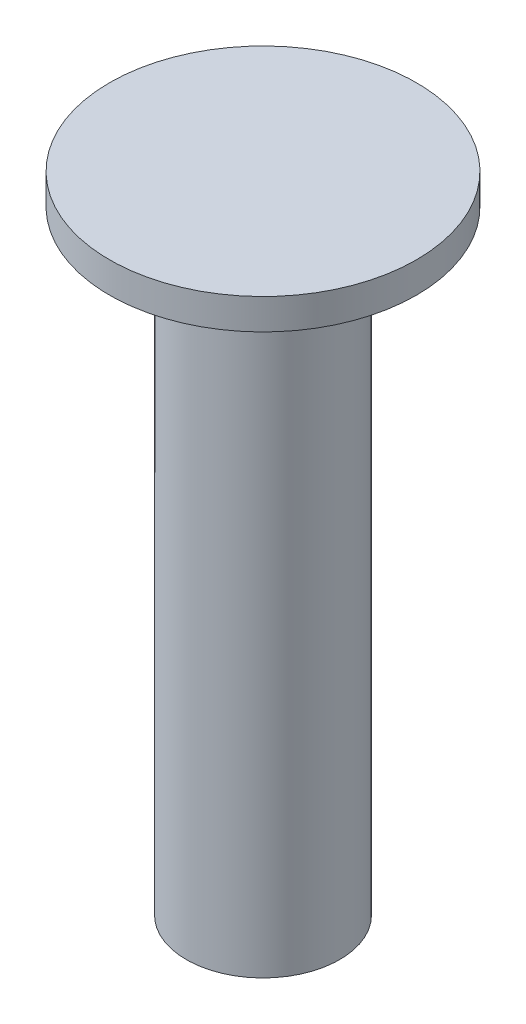
ISO-10303-21;
HEADER;
FILE_DESCRIPTION(('STEP AP214'),'2;1');
FILE_NAME('part.step','',(''),(''),'','','');
FILE_SCHEMA(('AUTOMOTIVE_DESIGN { 1 0 10303 214 1 1 1 1 }'));
ENDSEC;
DATA;
#1=APPLICATION_CONTEXT('core data for automotive mechanical design processes');
#2=APPLICATION_PROTOCOL_DEFINITION('international standard','automotive_design',2000,#1);
#3=PRODUCT_CONTEXT('',#1,'mechanical');
#4=PRODUCT('Part','Part','',(#3));
#5=PRODUCT_RELATED_PRODUCT_CATEGORY('part','',(#4));
#6=PRODUCT_DEFINITION_FORMATION('','',#4);
#7=PRODUCT_DEFINITION_CONTEXT('part definition',#1,'design');
#8=PRODUCT_DEFINITION('design','',#6,#7);
#9=PRODUCT_DEFINITION_SHAPE('','',#8);
#10=(LENGTH_UNIT() NAMED_UNIT(*) SI_UNIT(.MILLI.,.METRE.));
#11=(NAMED_UNIT(*) PLANE_ANGLE_UNIT() SI_UNIT($,.RADIAN.));
#12=(NAMED_UNIT(*) SI_UNIT($,.STERADIAN.) SOLID_ANGLE_UNIT());
#13=UNCERTAINTY_MEASURE_WITH_UNIT(LENGTH_MEASURE(1.E-05),#10,'distance_accuracy_value','');
#14=(GEOMETRIC_REPRESENTATION_CONTEXT(3) GLOBAL_UNCERTAINTY_ASSIGNED_CONTEXT((#13)) GLOBAL_UNIT_ASSIGNED_CONTEXT((#10,
#11,#12)) REPRESENTATION_CONTEXT('',''));
#15=CARTESIAN_POINT('',(0.,0.,0.));
#16=DIRECTION('',(0.,0.,1.));
#17=DIRECTION('',(1.,0.,0.));
#18=AXIS2_PLACEMENT_3D('',#15,#16,#17);
#19=CARTESIAN_POINT('',(0.,0.,0.));
#20=DIRECTION('',(0.,-1.,0.));
#21=DIRECTION('',(1.,0.,0.));
#22=AXIS2_PLACEMENT_3D('',#19,#20,#21);
#23=PLANE('',#22);
#24=CARTESIAN_POINT('',(0.,0.,0.));
#25=DIRECTION('',(0.,1.,0.));
#26=DIRECTION('',(-1.,0.,0.));
#27=AXIS2_PLACEMENT_3D('',#24,#25,#26);
#28=CIRCLE('',#27,2.5);
#29=CARTESIAN_POINT('',(-2.5,0.,0.));
#30=VERTEX_POINT('',#29);
#31=EDGE_CURVE('E10',#30,#30,#28,.T.);
#32=ORIENTED_EDGE('',*,*,#31,.F.);
#33=EDGE_LOOP('',(#32));
#34=FACE_BOUND('',#33,.T.);
#35=ADVANCED_FACE('F31',(#34),#23,.T.);
#36=CARTESIAN_POINT('',(0.,21.,0.));
#37=DIRECTION('',(0.,1.,0.));
#38=DIRECTION('',(-1.,0.,0.));
#39=AXIS2_PLACEMENT_3D('',#36,#37,#38);
#40=CYLINDRICAL_SURFACE('',#39,2.5);
#41=ORIENTED_EDGE('',*,*,#31,.T.);
#42=EDGE_LOOP('',(#41));
#43=FACE_BOUND('',#42,.T.);
#44=CARTESIAN_POINT('',(0.,20.,0.));
#45=DIRECTION('',(0.,1.,0.));
#46=DIRECTION('',(-1.,0.,0.));
#47=AXIS2_PLACEMENT_3D('',#44,#45,#46);
#48=CIRCLE('',#47,2.5);
#49=CARTESIAN_POINT('',(-2.5,20.,0.));
#50=VERTEX_POINT('',#49);
#51=EDGE_CURVE('E37',#50,#50,#48,.T.);
#52=ORIENTED_EDGE('',*,*,#51,.F.);
#53=EDGE_LOOP('',(#52));
#54=FACE_BOUND('',#53,.T.);
#55=ADVANCED_FACE('F63',(#43,#54),#40,.T.);
#56=CARTESIAN_POINT('',(-2.5,20.,0.));
#57=DIRECTION('',(0.,-1.,0.));
#58=DIRECTION('',(1.,0.,0.));
#59=AXIS2_PLACEMENT_3D('',#56,#57,#58);
#60=PLANE('',#59);
#61=ORIENTED_EDGE('',*,*,#51,.T.);
#62=EDGE_LOOP('',(#61));
#63=FACE_BOUND('',#62,.T.);
#64=CARTESIAN_POINT('',(0.,20.,0.));
#65=DIRECTION('',(0.,1.,0.));
#66=DIRECTION('',(-1.,0.,0.));
#67=AXIS2_PLACEMENT_3D('',#64,#65,#66);
#68=CIRCLE('',#67,5.);
#69=CARTESIAN_POINT('',(-5.,20.,0.));
#70=VERTEX_POINT('',#69);
#71=EDGE_CURVE('E41',#70,#70,#68,.T.);
#72=ORIENTED_EDGE('',*,*,#71,.F.);
#73=EDGE_LOOP('',(#72));
#74=FACE_BOUND('',#73,.T.);
#75=ADVANCED_FACE('F55',(#63,#74),#60,.T.);
#76=CARTESIAN_POINT('',(0.,21.,0.));
#77=DIRECTION('',(0.,1.,0.));
#78=DIRECTION('',(-1.,0.,0.));
#79=AXIS2_PLACEMENT_3D('',#76,#77,#78);
#80=CYLINDRICAL_SURFACE('',#79,5.);
#81=ORIENTED_EDGE('',*,*,#71,.T.);
#82=EDGE_LOOP('',(#81));
#83=FACE_BOUND('',#82,.T.);
#84=CARTESIAN_POINT('',(0.,21.,0.));
#85=DIRECTION('',(0.,1.,0.));
#86=DIRECTION('',(-1.,0.,0.));
#87=AXIS2_PLACEMENT_3D('',#84,#85,#86);
#88=CIRCLE('',#87,5.);
#89=CARTESIAN_POINT('',(-5.,21.,0.));
#90=VERTEX_POINT('',#89);
#91=EDGE_CURVE('E45',#90,#90,#88,.T.);
#92=ORIENTED_EDGE('',*,*,#91,.F.);
#93=EDGE_LOOP('',(#92));
#94=FACE_BOUND('',#93,.T.);
#95=ADVANCED_FACE('F53',(#83,#94),#80,.T.);
#96=CARTESIAN_POINT('',(-5.,21.,0.));
#97=DIRECTION('',(0.,1.,0.));
#98=DIRECTION('',(-1.,0.,0.));
#99=AXIS2_PLACEMENT_3D('',#96,#97,#98);
#100=PLANE('',#99);
#101=ORIENTED_EDGE('',*,*,#91,.T.);
#102=EDGE_LOOP('',(#101));
#103=FACE_BOUND('',#102,.T.);
#104=ADVANCED_FACE('F51',(#103),#100,.T.);
#105=CLOSED_SHELL('',(#35,#55,#75,#95,#104));
#106=MANIFOLD_SOLID_BREP('B2',#105);
#107=ADVANCED_BREP_SHAPE_REPRESENTATION('',(#18,#106),#14);
#108=SHAPE_DEFINITION_REPRESENTATION(#9,#107);
ENDSEC;
END-ISO-10303-21;
